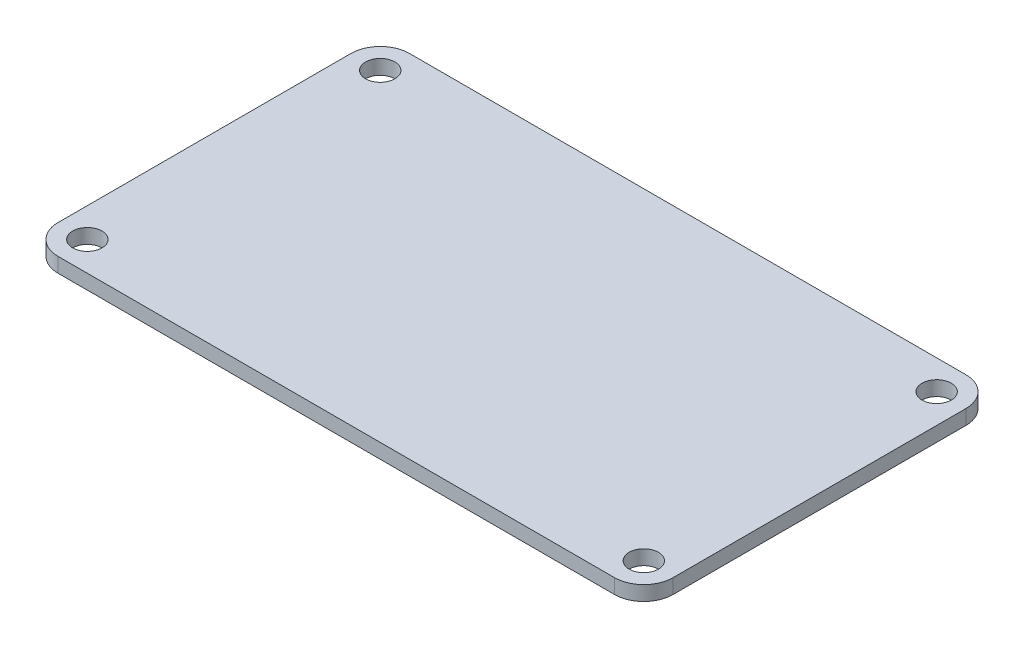
ISO-10303-21;
HEADER;
FILE_DESCRIPTION(('STEP AP214'),'2;1');
FILE_NAME('part.step','',(''),(''),'','','');
FILE_SCHEMA(('AUTOMOTIVE_DESIGN { 1 0 10303 214 1 1 1 1 }'));
ENDSEC;
DATA;
#1=APPLICATION_CONTEXT('core data for automotive mechanical design processes');
#2=APPLICATION_PROTOCOL_DEFINITION('international standard','automotive_design',2000,#1);
#3=PRODUCT_CONTEXT('',#1,'mechanical');
#4=PRODUCT('Part','Part','',(#3));
#5=PRODUCT_RELATED_PRODUCT_CATEGORY('part','',(#4));
#6=PRODUCT_DEFINITION_FORMATION('','',#4);
#7=PRODUCT_DEFINITION_CONTEXT('part definition',#1,'design');
#8=PRODUCT_DEFINITION('design','',#6,#7);
#9=PRODUCT_DEFINITION_SHAPE('','',#8);
#10=(LENGTH_UNIT() NAMED_UNIT(*) SI_UNIT(.MILLI.,.METRE.));
#11=(NAMED_UNIT(*) PLANE_ANGLE_UNIT() SI_UNIT($,.RADIAN.));
#12=(NAMED_UNIT(*) SI_UNIT($,.STERADIAN.) SOLID_ANGLE_UNIT());
#13=UNCERTAINTY_MEASURE_WITH_UNIT(LENGTH_MEASURE(1.E-05),#10,'distance_accuracy_value','');
#14=(GEOMETRIC_REPRESENTATION_CONTEXT(3) GLOBAL_UNCERTAINTY_ASSIGNED_CONTEXT((#13)) GLOBAL_UNIT_ASSIGNED_CONTEXT((#10,
#11,#12)) REPRESENTATION_CONTEXT('',''));
#15=CARTESIAN_POINT('',(0.,0.,0.));
#16=DIRECTION('',(0.,0.,1.));
#17=DIRECTION('',(1.,0.,0.));
#18=AXIS2_PLACEMENT_3D('',#15,#16,#17);
#19=CARTESIAN_POINT('',(21.,1.,12.));
#20=DIRECTION('',(-1.,0.,0.));
#21=DIRECTION('',(0.,0.,1.));
#22=AXIS2_PLACEMENT_3D('',#19,#20,#21);
#23=PLANE('',#22);
#24=DIRECTION('',(0.,0.,-1.));
#25=VECTOR('',#24,1.);
#26=CARTESIAN_POINT('',(21.,1.,12.));
#27=LINE('',#26,#25);
#28=CARTESIAN_POINT('',(21.,1.,10.));
#29=VERTEX_POINT('',#28);
#30=CARTESIAN_POINT('',(21.,1.,-10.));
#31=VERTEX_POINT('',#30);
#32=EDGE_CURVE('E117',#29,#31,#27,.T.);
#33=ORIENTED_EDGE('',*,*,#32,.F.);
#34=DIRECTION('',(0.,-1.,0.));
#35=VECTOR('',#34,1.);
#36=CARTESIAN_POINT('',(21.,1.,10.));
#37=LINE('',#36,#35);
#38=CARTESIAN_POINT('',(21.,0.,10.));
#39=VERTEX_POINT('',#38);
#40=EDGE_CURVE('E102',#29,#39,#37,.T.);
#41=ORIENTED_EDGE('',*,*,#40,.T.);
#42=DIRECTION('',(0.,0.,-1.));
#43=VECTOR('',#42,1.);
#44=CARTESIAN_POINT('',(21.,0.,12.));
#45=LINE('',#44,#43);
#46=CARTESIAN_POINT('',(21.,0.,-10.));
#47=VERTEX_POINT('',#46);
#48=EDGE_CURVE('E114',#39,#47,#45,.T.);
#49=ORIENTED_EDGE('',*,*,#48,.T.);
#50=DIRECTION('',(0.,-1.,0.));
#51=VECTOR('',#50,1.);
#52=CARTESIAN_POINT('',(21.,1.,-10.));
#53=LINE('',#52,#51);
#54=EDGE_CURVE('E119',#47,#31,#53,.F.);
#55=ORIENTED_EDGE('',*,*,#54,.T.);
#56=EDGE_LOOP('',(#33,#41,#49,#55));
#57=FACE_BOUND('',#56,.T.);
#58=ADVANCED_FACE('F32',(#57),#23,.F.);
#59=CARTESIAN_POINT('',(-21.,1.,-12.));
#60=DIRECTION('',(0.,0.,1.));
#61=DIRECTION('',(1.,0.,0.));
#62=AXIS2_PLACEMENT_3D('',#59,#60,#61);
#63=PLANE('',#62);
#64=DIRECTION('',(-1.,0.,0.));
#65=VECTOR('',#64,1.);
#66=CARTESIAN_POINT('',(-21.,1.,-12.));
#67=LINE('',#66,#65);
#68=CARTESIAN_POINT('',(19.,1.,-12.));
#69=VERTEX_POINT('',#68);
#70=CARTESIAN_POINT('',(-19.,1.,-12.));
#71=VERTEX_POINT('',#70);
#72=EDGE_CURVE('E163',#69,#71,#67,.T.);
#73=ORIENTED_EDGE('',*,*,#72,.F.);
#74=DIRECTION('',(0.,-1.,0.));
#75=VECTOR('',#74,1.);
#76=CARTESIAN_POINT('',(19.,1.,-12.));
#77=LINE('',#76,#75);
#78=CARTESIAN_POINT('',(19.,0.,-12.));
#79=VERTEX_POINT('',#78);
#80=EDGE_CURVE('E156',#69,#79,#77,.T.);
#81=ORIENTED_EDGE('',*,*,#80,.T.);
#82=DIRECTION('',(-1.,0.,0.));
#83=VECTOR('',#82,1.);
#84=CARTESIAN_POINT('',(-21.,0.,-12.));
#85=LINE('',#84,#83);
#86=CARTESIAN_POINT('',(-19.,0.,-12.));
#87=VERTEX_POINT('',#86);
#88=EDGE_CURVE('E123',#79,#87,#85,.T.);
#89=ORIENTED_EDGE('',*,*,#88,.T.);
#90=DIRECTION('',(0.,-1.,0.));
#91=VECTOR('',#90,1.);
#92=CARTESIAN_POINT('',(-19.,1.,-12.));
#93=LINE('',#92,#91);
#94=EDGE_CURVE('E154',#87,#71,#93,.F.);
#95=ORIENTED_EDGE('',*,*,#94,.T.);
#96=EDGE_LOOP('',(#73,#81,#89,#95));
#97=FACE_BOUND('',#96,.T.);
#98=ADVANCED_FACE('F161',(#97),#63,.F.);
#99=CARTESIAN_POINT('',(-21.,1.,12.));
#100=DIRECTION('',(1.,0.,0.));
#101=DIRECTION('',(0.,0.,-1.));
#102=AXIS2_PLACEMENT_3D('',#99,#100,#101);
#103=PLANE('',#102);
#104=DIRECTION('',(0.,0.,1.));
#105=VECTOR('',#104,1.);
#106=CARTESIAN_POINT('',(-21.,1.,12.));
#107=LINE('',#106,#105);
#108=CARTESIAN_POINT('',(-21.,1.,-10.));
#109=VERTEX_POINT('',#108);
#110=CARTESIAN_POINT('',(-21.,1.,10.));
#111=VERTEX_POINT('',#110);
#112=EDGE_CURVE('E171',#109,#111,#107,.T.);
#113=ORIENTED_EDGE('',*,*,#112,.F.);
#114=DIRECTION('',(0.,-1.,0.));
#115=VECTOR('',#114,1.);
#116=CARTESIAN_POINT('',(-21.,1.,-10.));
#117=LINE('',#116,#115);
#118=CARTESIAN_POINT('',(-21.,0.,-10.));
#119=VERTEX_POINT('',#118);
#120=EDGE_CURVE('E11',#109,#119,#117,.T.);
#121=ORIENTED_EDGE('',*,*,#120,.T.);
#122=DIRECTION('',(0.,0.,1.));
#123=VECTOR('',#122,1.);
#124=CARTESIAN_POINT('',(-21.,0.,12.));
#125=LINE('',#124,#123);
#126=CARTESIAN_POINT('',(-21.,0.,10.));
#127=VERTEX_POINT('',#126);
#128=EDGE_CURVE('E127',#119,#127,#125,.T.);
#129=ORIENTED_EDGE('',*,*,#128,.T.);
#130=DIRECTION('',(0.,-1.,0.));
#131=VECTOR('',#130,1.);
#132=CARTESIAN_POINT('',(-21.,1.,10.));
#133=LINE('',#132,#131);
#134=EDGE_CURVE('E40',#127,#111,#133,.F.);
#135=ORIENTED_EDGE('',*,*,#134,.T.);
#136=EDGE_LOOP('',(#113,#121,#129,#135));
#137=FACE_BOUND('',#136,.T.);
#138=ADVANCED_FACE('F170',(#137),#103,.F.);
#139=CARTESIAN_POINT('',(-21.,1.,12.));
#140=DIRECTION('',(0.,0.,-1.));
#141=DIRECTION('',(-1.,0.,0.));
#142=AXIS2_PLACEMENT_3D('',#139,#140,#141);
#143=PLANE('',#142);
#144=DIRECTION('',(1.,0.,0.));
#145=VECTOR('',#144,1.);
#146=CARTESIAN_POINT('',(-21.,0.,12.));
#147=LINE('',#146,#145);
#148=CARTESIAN_POINT('',(-19.,0.,12.));
#149=VERTEX_POINT('',#148);
#150=CARTESIAN_POINT('',(19.,0.,12.));
#151=VERTEX_POINT('',#150);
#152=EDGE_CURVE('E137',#149,#151,#147,.T.);
#153=ORIENTED_EDGE('',*,*,#152,.T.);
#154=DIRECTION('',(0.,-1.,0.));
#155=VECTOR('',#154,1.);
#156=CARTESIAN_POINT('',(19.,1.,12.));
#157=LINE('',#156,#155);
#158=CARTESIAN_POINT('',(19.,1.,12.));
#159=VERTEX_POINT('',#158);
#160=EDGE_CURVE('E103',#151,#159,#157,.F.);
#161=ORIENTED_EDGE('',*,*,#160,.T.);
#162=DIRECTION('',(1.,0.,0.));
#163=VECTOR('',#162,1.);
#164=CARTESIAN_POINT('',(-21.,1.,12.));
#165=LINE('',#164,#163);
#166=CARTESIAN_POINT('',(-19.,1.,12.));
#167=VERTEX_POINT('',#166);
#168=EDGE_CURVE('E133',#167,#159,#165,.T.);
#169=ORIENTED_EDGE('',*,*,#168,.F.);
#170=DIRECTION('',(0.,-1.,0.));
#171=VECTOR('',#170,1.);
#172=CARTESIAN_POINT('',(-19.,1.,12.));
#173=LINE('',#172,#171);
#174=EDGE_CURVE('E108',#167,#149,#173,.T.);
#175=ORIENTED_EDGE('',*,*,#174,.T.);
#176=EDGE_LOOP('',(#153,#161,#169,#175));
#177=FACE_BOUND('',#176,.T.);
#178=ADVANCED_FACE('F211',(#177),#143,.F.);
#179=CARTESIAN_POINT('',(0.,1.,0.));
#180=DIRECTION('',(0.,-1.,0.));
#181=DIRECTION('',(0.,0.,-1.));
#182=AXIS2_PLACEMENT_3D('',#179,#180,#181);
#183=PLANE('',#182);
#184=CARTESIAN_POINT('',(19.,1.,-10.));
#185=DIRECTION('',(0.,1.,0.));
#186=DIRECTION('',(0.,0.,1.));
#187=AXIS2_PLACEMENT_3D('',#184,#185,#186);
#188=CIRCLE('',#187,1.);
#189=CARTESIAN_POINT('',(19.,1.,-9.));
#190=VERTEX_POINT('',#189);
#191=EDGE_CURVE('E180',#190,#190,#188,.T.);
#192=ORIENTED_EDGE('',*,*,#191,.F.);
#193=EDGE_LOOP('',(#192));
#194=FACE_BOUND('',#193,.T.);
#195=CARTESIAN_POINT('',(19.,1.,10.));
#196=DIRECTION('',(0.,1.,0.));
#197=DIRECTION('',(0.,0.,1.));
#198=AXIS2_PLACEMENT_3D('',#195,#196,#197);
#199=CIRCLE('',#198,1.);
#200=CARTESIAN_POINT('',(19.,1.,11.));
#201=VERTEX_POINT('',#200);
#202=EDGE_CURVE('E186',#201,#201,#199,.T.);
#203=ORIENTED_EDGE('',*,*,#202,.F.);
#204=EDGE_LOOP('',(#203));
#205=FACE_BOUND('',#204,.T.);
#206=CARTESIAN_POINT('',(-19.,1.,10.));
#207=DIRECTION('',(0.,1.,0.));
#208=DIRECTION('',(0.,0.,1.));
#209=AXIS2_PLACEMENT_3D('',#206,#207,#208);
#210=CIRCLE('',#209,1.);
#211=CARTESIAN_POINT('',(-19.,1.,11.));
#212=VERTEX_POINT('',#211);
#213=EDGE_CURVE('E192',#212,#212,#210,.T.);
#214=ORIENTED_EDGE('',*,*,#213,.F.);
#215=EDGE_LOOP('',(#214));
#216=FACE_BOUND('',#215,.T.);
#217=CARTESIAN_POINT('',(-19.,1.,-10.));
#218=DIRECTION('',(0.,1.,0.));
#219=DIRECTION('',(0.,0.,1.));
#220=AXIS2_PLACEMENT_3D('',#217,#218,#219);
#221=CIRCLE('',#220,1.);
#222=CARTESIAN_POINT('',(-19.,1.,-9.));
#223=VERTEX_POINT('',#222);
#224=EDGE_CURVE('E130',#223,#223,#221,.T.);
#225=ORIENTED_EDGE('',*,*,#224,.F.);
#226=EDGE_LOOP('',(#225));
#227=FACE_BOUND('',#226,.T.);
#228=ORIENTED_EDGE('',*,*,#168,.T.);
#229=CARTESIAN_POINT('',(19.,1.,10.));
#230=DIRECTION('',(0.,-1.,0.));
#231=DIRECTION('',(0.,0.,-1.));
#232=AXIS2_PLACEMENT_3D('',#229,#230,#231);
#233=CIRCLE('',#232,2.);
#234=EDGE_CURVE('E152',#159,#29,#233,.F.);
#235=ORIENTED_EDGE('',*,*,#234,.T.);
#236=ORIENTED_EDGE('',*,*,#32,.T.);
#237=CARTESIAN_POINT('',(19.,1.,-10.));
#238=DIRECTION('',(0.,-1.,0.));
#239=DIRECTION('',(0.,0.,-1.));
#240=AXIS2_PLACEMENT_3D('',#237,#238,#239);
#241=CIRCLE('',#240,2.);
#242=EDGE_CURVE('E150',#31,#69,#241,.F.);
#243=ORIENTED_EDGE('',*,*,#242,.T.);
#244=ORIENTED_EDGE('',*,*,#72,.T.);
#245=CARTESIAN_POINT('',(-19.,1.,-10.));
#246=DIRECTION('',(0.,-1.,0.));
#247=DIRECTION('',(0.,0.,-1.));
#248=AXIS2_PLACEMENT_3D('',#245,#246,#247);
#249=CIRCLE('',#248,2.);
#250=EDGE_CURVE('E53',#71,#109,#249,.F.);
#251=ORIENTED_EDGE('',*,*,#250,.T.);
#252=ORIENTED_EDGE('',*,*,#112,.T.);
#253=CARTESIAN_POINT('',(-19.,1.,10.));
#254=DIRECTION('',(0.,-1.,0.));
#255=DIRECTION('',(0.,0.,-1.));
#256=AXIS2_PLACEMENT_3D('',#253,#254,#255);
#257=CIRCLE('',#256,2.);
#258=EDGE_CURVE('E147',#111,#167,#257,.F.);
#259=ORIENTED_EDGE('',*,*,#258,.T.);
#260=EDGE_LOOP('',(#228,#235,#236,#243,#244,#251,#252,#259));
#261=FACE_BOUND('',#260,.T.);
#262=ADVANCED_FACE('F208',(#194,#205,#216,#227,#261),#183,.F.);
#263=CARTESIAN_POINT('',(0.,0.,0.));
#264=DIRECTION('',(0.,-1.,0.));
#265=DIRECTION('',(0.,0.,-1.));
#266=AXIS2_PLACEMENT_3D('',#263,#264,#265);
#267=PLANE('',#266);
#268=CARTESIAN_POINT('',(19.,0.,-10.));
#269=DIRECTION('',(0.,1.,0.));
#270=DIRECTION('',(0.,0.,1.));
#271=AXIS2_PLACEMENT_3D('',#268,#269,#270);
#272=CIRCLE('',#271,1.);
#273=CARTESIAN_POINT('',(19.,0.,-9.));
#274=VERTEX_POINT('',#273);
#275=EDGE_CURVE('E183',#274,#274,#272,.T.);
#276=ORIENTED_EDGE('',*,*,#275,.T.);
#277=EDGE_LOOP('',(#276));
#278=FACE_BOUND('',#277,.T.);
#279=CARTESIAN_POINT('',(19.,0.,10.));
#280=DIRECTION('',(0.,1.,0.));
#281=DIRECTION('',(0.,0.,1.));
#282=AXIS2_PLACEMENT_3D('',#279,#280,#281);
#283=CIRCLE('',#282,1.);
#284=CARTESIAN_POINT('',(19.,0.,11.));
#285=VERTEX_POINT('',#284);
#286=EDGE_CURVE('E189',#285,#285,#283,.T.);
#287=ORIENTED_EDGE('',*,*,#286,.T.);
#288=EDGE_LOOP('',(#287));
#289=FACE_BOUND('',#288,.T.);
#290=CARTESIAN_POINT('',(-19.,0.,10.));
#291=DIRECTION('',(0.,1.,0.));
#292=DIRECTION('',(0.,0.,1.));
#293=AXIS2_PLACEMENT_3D('',#290,#291,#292);
#294=CIRCLE('',#293,1.);
#295=CARTESIAN_POINT('',(-19.,0.,11.));
#296=VERTEX_POINT('',#295);
#297=EDGE_CURVE('E178',#296,#296,#294,.T.);
#298=ORIENTED_EDGE('',*,*,#297,.T.);
#299=EDGE_LOOP('',(#298));
#300=FACE_BOUND('',#299,.T.);
#301=CARTESIAN_POINT('',(-19.,0.,-10.));
#302=DIRECTION('',(0.,1.,0.));
#303=DIRECTION('',(0.,0.,1.));
#304=AXIS2_PLACEMENT_3D('',#301,#302,#303);
#305=CIRCLE('',#304,1.);
#306=CARTESIAN_POINT('',(-19.,0.,-9.));
#307=VERTEX_POINT('',#306);
#308=EDGE_CURVE('E124',#307,#307,#305,.T.);
#309=ORIENTED_EDGE('',*,*,#308,.T.);
#310=EDGE_LOOP('',(#309));
#311=FACE_BOUND('',#310,.T.);
#312=ORIENTED_EDGE('',*,*,#48,.F.);
#313=CARTESIAN_POINT('',(19.,0.,10.));
#314=DIRECTION('',(0.,-1.,0.));
#315=DIRECTION('',(0.,0.,-1.));
#316=AXIS2_PLACEMENT_3D('',#313,#314,#315);
#317=CIRCLE('',#316,2.);
#318=EDGE_CURVE('E98',#39,#151,#317,.T.);
#319=ORIENTED_EDGE('',*,*,#318,.T.);
#320=ORIENTED_EDGE('',*,*,#152,.F.);
#321=CARTESIAN_POINT('',(-19.,0.,10.));
#322=DIRECTION('',(0.,-1.,0.));
#323=DIRECTION('',(0.,0.,-1.));
#324=AXIS2_PLACEMENT_3D('',#321,#322,#323);
#325=CIRCLE('',#324,2.);
#326=EDGE_CURVE('E118',#149,#127,#325,.T.);
#327=ORIENTED_EDGE('',*,*,#326,.T.);
#328=ORIENTED_EDGE('',*,*,#128,.F.);
#329=CARTESIAN_POINT('',(-19.,0.,-10.));
#330=DIRECTION('',(0.,-1.,0.));
#331=DIRECTION('',(0.,0.,-1.));
#332=AXIS2_PLACEMENT_3D('',#329,#330,#331);
#333=CIRCLE('',#332,2.);
#334=EDGE_CURVE('E141',#119,#87,#333,.T.);
#335=ORIENTED_EDGE('',*,*,#334,.T.);
#336=ORIENTED_EDGE('',*,*,#88,.F.);
#337=CARTESIAN_POINT('',(19.,0.,-10.));
#338=DIRECTION('',(0.,-1.,0.));
#339=DIRECTION('',(0.,0.,-1.));
#340=AXIS2_PLACEMENT_3D('',#337,#338,#339);
#341=CIRCLE('',#340,2.);
#342=EDGE_CURVE('E109',#79,#47,#341,.T.);
#343=ORIENTED_EDGE('',*,*,#342,.T.);
#344=EDGE_LOOP('',(#312,#319,#320,#327,#328,#335,#336,#343));
#345=FACE_BOUND('',#344,.T.);
#346=ADVANCED_FACE('F121',(#278,#289,#300,#311,#345),#267,.T.);
#347=CARTESIAN_POINT('',(-19.,0.,-10.));
#348=DIRECTION('',(0.,1.,0.));
#349=DIRECTION('',(0.,0.,1.));
#350=AXIS2_PLACEMENT_3D('',#347,#348,#349);
#351=CYLINDRICAL_SURFACE('',#350,1.);
#352=ORIENTED_EDGE('',*,*,#308,.F.);
#353=EDGE_LOOP('',(#352));
#354=FACE_BOUND('',#353,.T.);
#355=ORIENTED_EDGE('',*,*,#224,.T.);
#356=EDGE_LOOP('',(#355));
#357=FACE_BOUND('',#356,.T.);
#358=ADVANCED_FACE('F204',(#354,#357),#351,.F.);
#359=CARTESIAN_POINT('',(-19.,0.,10.));
#360=DIRECTION('',(0.,1.,0.));
#361=DIRECTION('',(0.,0.,1.));
#362=AXIS2_PLACEMENT_3D('',#359,#360,#361);
#363=CYLINDRICAL_SURFACE('',#362,1.);
#364=ORIENTED_EDGE('',*,*,#297,.F.);
#365=EDGE_LOOP('',(#364));
#366=FACE_BOUND('',#365,.T.);
#367=ORIENTED_EDGE('',*,*,#213,.T.);
#368=EDGE_LOOP('',(#367));
#369=FACE_BOUND('',#368,.T.);
#370=ADVANCED_FACE('F200',(#366,#369),#363,.F.);
#371=CARTESIAN_POINT('',(19.,0.,10.));
#372=DIRECTION('',(0.,1.,0.));
#373=DIRECTION('',(0.,0.,1.));
#374=AXIS2_PLACEMENT_3D('',#371,#372,#373);
#375=CYLINDRICAL_SURFACE('',#374,1.);
#376=ORIENTED_EDGE('',*,*,#286,.F.);
#377=EDGE_LOOP('',(#376));
#378=FACE_BOUND('',#377,.T.);
#379=ORIENTED_EDGE('',*,*,#202,.T.);
#380=EDGE_LOOP('',(#379));
#381=FACE_BOUND('',#380,.T.);
#382=ADVANCED_FACE('F203',(#378,#381),#375,.F.);
#383=CARTESIAN_POINT('',(19.,0.,-10.));
#384=DIRECTION('',(0.,1.,0.));
#385=DIRECTION('',(0.,0.,1.));
#386=AXIS2_PLACEMENT_3D('',#383,#384,#385);
#387=CYLINDRICAL_SURFACE('',#386,1.);
#388=ORIENTED_EDGE('',*,*,#275,.F.);
#389=EDGE_LOOP('',(#388));
#390=FACE_BOUND('',#389,.T.);
#391=ORIENTED_EDGE('',*,*,#191,.T.);
#392=EDGE_LOOP('',(#391));
#393=FACE_BOUND('',#392,.T.);
#394=ADVANCED_FACE('F234',(#390,#393),#387,.F.);
#395=CARTESIAN_POINT('',(19.,1.,10.));
#396=DIRECTION('',(0.,-1.,0.));
#397=DIRECTION('',(0.,0.,-1.));
#398=AXIS2_PLACEMENT_3D('',#395,#396,#397);
#399=CYLINDRICAL_SURFACE('',#398,2.);
#400=ORIENTED_EDGE('',*,*,#234,.F.);
#401=ORIENTED_EDGE('',*,*,#160,.F.);
#402=ORIENTED_EDGE('',*,*,#318,.F.);
#403=ORIENTED_EDGE('',*,*,#40,.F.);
#404=EDGE_LOOP('',(#400,#401,#402,#403));
#405=FACE_BOUND('',#404,.T.);
#406=ADVANCED_FACE('F101',(#405),#399,.T.);
#407=CARTESIAN_POINT('',(19.,1.,-10.));
#408=DIRECTION('',(0.,-1.,0.));
#409=DIRECTION('',(0.,0.,-1.));
#410=AXIS2_PLACEMENT_3D('',#407,#408,#409);
#411=CYLINDRICAL_SURFACE('',#410,2.);
#412=ORIENTED_EDGE('',*,*,#242,.F.);
#413=ORIENTED_EDGE('',*,*,#54,.F.);
#414=ORIENTED_EDGE('',*,*,#342,.F.);
#415=ORIENTED_EDGE('',*,*,#80,.F.);
#416=EDGE_LOOP('',(#412,#413,#414,#415));
#417=FACE_BOUND('',#416,.T.);
#418=ADVANCED_FACE('F223',(#417),#411,.T.);
#419=CARTESIAN_POINT('',(-19.,1.,-10.));
#420=DIRECTION('',(0.,-1.,0.));
#421=DIRECTION('',(0.,0.,-1.));
#422=AXIS2_PLACEMENT_3D('',#419,#420,#421);
#423=CYLINDRICAL_SURFACE('',#422,2.);
#424=ORIENTED_EDGE('',*,*,#250,.F.);
#425=ORIENTED_EDGE('',*,*,#94,.F.);
#426=ORIENTED_EDGE('',*,*,#334,.F.);
#427=ORIENTED_EDGE('',*,*,#120,.F.);
#428=EDGE_LOOP('',(#424,#425,#426,#427));
#429=FACE_BOUND('',#428,.T.);
#430=ADVANCED_FACE('F169',(#429),#423,.T.);
#431=CARTESIAN_POINT('',(-19.,1.,10.));
#432=DIRECTION('',(0.,-1.,0.));
#433=DIRECTION('',(0.,0.,-1.));
#434=AXIS2_PLACEMENT_3D('',#431,#432,#433);
#435=CYLINDRICAL_SURFACE('',#434,2.);
#436=ORIENTED_EDGE('',*,*,#258,.F.);
#437=ORIENTED_EDGE('',*,*,#134,.F.);
#438=ORIENTED_EDGE('',*,*,#326,.F.);
#439=ORIENTED_EDGE('',*,*,#174,.F.);
#440=EDGE_LOOP('',(#436,#437,#438,#439));
#441=FACE_BOUND('',#440,.T.);
#442=ADVANCED_FACE('F34',(#441),#435,.T.);
#443=CLOSED_SHELL('',(#58,#98,#138,#178,#262,#346,#358,#370,#382,#394,#406,#418,#430,#442));
#444=MANIFOLD_SOLID_BREP('B2',#443);
#445=ADVANCED_BREP_SHAPE_REPRESENTATION('',(#18,#444),#14);
#446=SHAPE_DEFINITION_REPRESENTATION(#9,#445);
ENDSEC;
END-ISO-10303-21;
